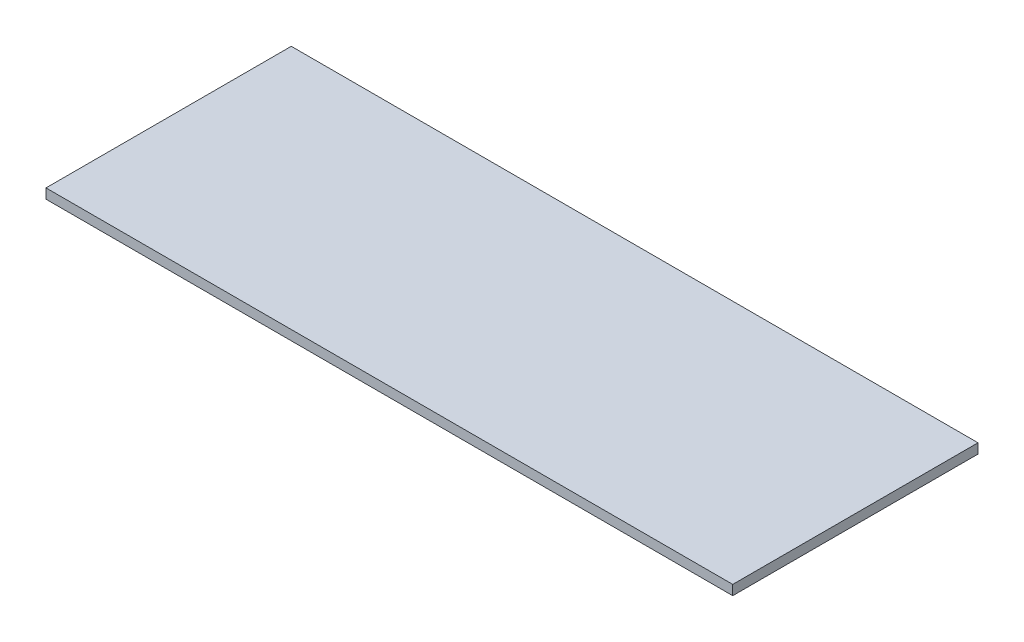
ISO-10303-21;
HEADER;
FILE_DESCRIPTION(('STEP AP214'),'2;1');
FILE_NAME('part.step','',(''),(''),'','','');
FILE_SCHEMA(('AUTOMOTIVE_DESIGN { 1 0 10303 214 1 1 1 1 }'));
ENDSEC;
DATA;
#1=APPLICATION_CONTEXT('core data for automotive mechanical design processes');
#2=APPLICATION_PROTOCOL_DEFINITION('international standard','automotive_design',2000,#1);
#3=PRODUCT_CONTEXT('',#1,'mechanical');
#4=PRODUCT('Part','Part','',(#3));
#5=PRODUCT_RELATED_PRODUCT_CATEGORY('part','',(#4));
#6=PRODUCT_DEFINITION_FORMATION('','',#4);
#7=PRODUCT_DEFINITION_CONTEXT('part definition',#1,'design');
#8=PRODUCT_DEFINITION('design','',#6,#7);
#9=PRODUCT_DEFINITION_SHAPE('','',#8);
#10=(LENGTH_UNIT() NAMED_UNIT(*) SI_UNIT(.MILLI.,.METRE.));
#11=(NAMED_UNIT(*) PLANE_ANGLE_UNIT() SI_UNIT($,.RADIAN.));
#12=(NAMED_UNIT(*) SI_UNIT($,.STERADIAN.) SOLID_ANGLE_UNIT());
#13=UNCERTAINTY_MEASURE_WITH_UNIT(LENGTH_MEASURE(1.E-05),#10,'distance_accuracy_value','');
#14=(GEOMETRIC_REPRESENTATION_CONTEXT(3) GLOBAL_UNCERTAINTY_ASSIGNED_CONTEXT((#13)) GLOBAL_UNIT_ASSIGNED_CONTEXT((#10,
#11,#12)) REPRESENTATION_CONTEXT('',''));
#15=CARTESIAN_POINT('',(0.,0.,0.));
#16=DIRECTION('',(0.,0.,1.));
#17=DIRECTION('',(1.,0.,0.));
#18=AXIS2_PLACEMENT_3D('',#15,#16,#17);
#19=CARTESIAN_POINT('',(-24.4855967078189,1.,-8.00411522633745));
#20=DIRECTION('',(1.,0.,0.));
#21=DIRECTION('',(0.,0.,-1.));
#22=AXIS2_PLACEMENT_3D('',#19,#20,#21);
#23=PLANE('',#22);
#24=DIRECTION('',(0.,0.,1.));
#25=VECTOR('',#24,1.);
#26=CARTESIAN_POINT('',(-24.4855967078189,0.,-8.00411522633745));
#27=LINE('',#26,#25);
#28=CARTESIAN_POINT('',(-24.4855967078189,0.,-8.00411522633745));
#29=VERTEX_POINT('',#28);
#30=CARTESIAN_POINT('',(-24.4855967078189,0.,16.9958847736625));
#31=VERTEX_POINT('',#30);
#32=EDGE_CURVE('E97',#29,#31,#27,.T.);
#33=ORIENTED_EDGE('',*,*,#32,.T.);
#34=DIRECTION('',(0.,-1.,0.));
#35=VECTOR('',#34,1.);
#36=CARTESIAN_POINT('',(-24.4855967078189,1.,16.9958847736625));
#37=LINE('',#36,#35);
#38=CARTESIAN_POINT('',(-24.4855967078189,1.,16.9958847736625));
#39=VERTEX_POINT('',#38);
#40=EDGE_CURVE('E11',#39,#31,#37,.T.);
#41=ORIENTED_EDGE('',*,*,#40,.F.);
#42=DIRECTION('',(0.,0.,1.));
#43=VECTOR('',#42,1.);
#44=CARTESIAN_POINT('',(-24.4855967078189,1.,-8.00411522633745));
#45=LINE('',#44,#43);
#46=CARTESIAN_POINT('',(-24.4855967078189,1.,-8.00411522633745));
#47=VERTEX_POINT('',#46);
#48=EDGE_CURVE('E85',#47,#39,#45,.T.);
#49=ORIENTED_EDGE('',*,*,#48,.F.);
#50=DIRECTION('',(0.,-1.,0.));
#51=VECTOR('',#50,1.);
#52=CARTESIAN_POINT('',(-24.4855967078189,1.,-8.00411522633745));
#53=LINE('',#52,#51);
#54=EDGE_CURVE('E93',#47,#29,#53,.T.);
#55=ORIENTED_EDGE('',*,*,#54,.T.);
#56=EDGE_LOOP('',(#33,#41,#49,#55));
#57=FACE_BOUND('',#56,.T.);
#58=ADVANCED_FACE('F34',(#57),#23,.F.);
#59=CARTESIAN_POINT('',(-24.4855967078189,1.,16.9958847736625));
#60=DIRECTION('',(0.,0.,-1.));
#61=DIRECTION('',(-1.,0.,0.));
#62=AXIS2_PLACEMENT_3D('',#59,#60,#61);
#63=PLANE('',#62);
#64=DIRECTION('',(1.,0.,0.));
#65=VECTOR('',#64,1.);
#66=CARTESIAN_POINT('',(-24.4855967078189,0.,16.9958847736625));
#67=LINE('',#66,#65);
#68=CARTESIAN_POINT('',(45.5144032921811,0.,16.9958847736625));
#69=VERTEX_POINT('',#68);
#70=EDGE_CURVE('E89',#31,#69,#67,.T.);
#71=ORIENTED_EDGE('',*,*,#70,.T.);
#72=DIRECTION('',(0.,-1.,0.));
#73=VECTOR('',#72,1.);
#74=CARTESIAN_POINT('',(45.5144032921811,1.,16.9958847736625));
#75=LINE('',#74,#73);
#76=CARTESIAN_POINT('',(45.5144032921811,1.,16.9958847736625));
#77=VERTEX_POINT('',#76);
#78=EDGE_CURVE('E42',#77,#69,#75,.T.);
#79=ORIENTED_EDGE('',*,*,#78,.F.);
#80=DIRECTION('',(1.,0.,0.));
#81=VECTOR('',#80,1.);
#82=CARTESIAN_POINT('',(-24.4855967078189,1.,16.9958847736625));
#83=LINE('',#82,#81);
#84=EDGE_CURVE('E80',#39,#77,#83,.T.);
#85=ORIENTED_EDGE('',*,*,#84,.F.);
#86=ORIENTED_EDGE('',*,*,#40,.T.);
#87=EDGE_LOOP('',(#71,#79,#85,#86));
#88=FACE_BOUND('',#87,.T.);
#89=ADVANCED_FACE('F88',(#88),#63,.F.);
#90=CARTESIAN_POINT('',(45.5144032921811,1.,-8.00411522633745));
#91=DIRECTION('',(-1.,0.,0.));
#92=DIRECTION('',(0.,0.,1.));
#93=AXIS2_PLACEMENT_3D('',#90,#91,#92);
#94=PLANE('',#93);
#95=DIRECTION('',(0.,0.,-1.));
#96=VECTOR('',#95,1.);
#97=CARTESIAN_POINT('',(45.5144032921811,0.,-8.00411522633745));
#98=LINE('',#97,#96);
#99=CARTESIAN_POINT('',(45.5144032921811,0.,-8.00411522633745));
#100=VERTEX_POINT('',#99);
#101=EDGE_CURVE('E67',#69,#100,#98,.T.);
#102=ORIENTED_EDGE('',*,*,#101,.T.);
#103=DIRECTION('',(0.,-1.,0.));
#104=VECTOR('',#103,1.);
#105=CARTESIAN_POINT('',(45.5144032921811,1.,-8.00411522633745));
#106=LINE('',#105,#104);
#107=CARTESIAN_POINT('',(45.5144032921811,1.,-8.00411522633745));
#108=VERTEX_POINT('',#107);
#109=EDGE_CURVE('E90',#108,#100,#106,.T.);
#110=ORIENTED_EDGE('',*,*,#109,.F.);
#111=DIRECTION('',(0.,0.,-1.));
#112=VECTOR('',#111,1.);
#113=CARTESIAN_POINT('',(45.5144032921811,1.,-8.00411522633745));
#114=LINE('',#113,#112);
#115=EDGE_CURVE('E83',#77,#108,#114,.T.);
#116=ORIENTED_EDGE('',*,*,#115,.F.);
#117=ORIENTED_EDGE('',*,*,#78,.T.);
#118=EDGE_LOOP('',(#102,#110,#116,#117));
#119=FACE_BOUND('',#118,.T.);
#120=ADVANCED_FACE('F91',(#119),#94,.F.);
#121=CARTESIAN_POINT('',(-24.4855967078189,1.,-8.00411522633745));
#122=DIRECTION('',(0.,0.,1.));
#123=DIRECTION('',(1.,0.,0.));
#124=AXIS2_PLACEMENT_3D('',#121,#122,#123);
#125=PLANE('',#124);
#126=DIRECTION('',(-1.,0.,0.));
#127=VECTOR('',#126,1.);
#128=CARTESIAN_POINT('',(-24.4855967078189,0.,-8.00411522633745));
#129=LINE('',#128,#127);
#130=EDGE_CURVE('E73',#100,#29,#129,.T.);
#131=ORIENTED_EDGE('',*,*,#130,.T.);
#132=ORIENTED_EDGE('',*,*,#54,.F.);
#133=DIRECTION('',(-1.,0.,0.));
#134=VECTOR('',#133,1.);
#135=CARTESIAN_POINT('',(-24.4855967078189,1.,-8.00411522633745));
#136=LINE('',#135,#134);
#137=EDGE_CURVE('E50',#108,#47,#136,.T.);
#138=ORIENTED_EDGE('',*,*,#137,.F.);
#139=ORIENTED_EDGE('',*,*,#109,.T.);
#140=EDGE_LOOP('',(#131,#132,#138,#139));
#141=FACE_BOUND('',#140,.T.);
#142=ADVANCED_FACE('F104',(#141),#125,.F.);
#143=CARTESIAN_POINT('',(0.,1.,0.));
#144=DIRECTION('',(0.,1.,0.));
#145=DIRECTION('',(0.,0.,1.));
#146=AXIS2_PLACEMENT_3D('',#143,#144,#145);
#147=PLANE('',#146);
#148=ORIENTED_EDGE('',*,*,#48,.T.);
#149=ORIENTED_EDGE('',*,*,#84,.T.);
#150=ORIENTED_EDGE('',*,*,#115,.T.);
#151=ORIENTED_EDGE('',*,*,#137,.T.);
#152=EDGE_LOOP('',(#148,#149,#150,#151));
#153=FACE_BOUND('',#152,.T.);
#154=ADVANCED_FACE('F81',(#153),#147,.T.);
#155=CARTESIAN_POINT('',(0.,0.,0.));
#156=DIRECTION('',(0.,1.,0.));
#157=DIRECTION('',(0.,0.,1.));
#158=AXIS2_PLACEMENT_3D('',#155,#156,#157);
#159=PLANE('',#158);
#160=ORIENTED_EDGE('',*,*,#32,.F.);
#161=ORIENTED_EDGE('',*,*,#130,.F.);
#162=ORIENTED_EDGE('',*,*,#101,.F.);
#163=ORIENTED_EDGE('',*,*,#70,.F.);
#164=EDGE_LOOP('',(#160,#161,#162,#163));
#165=FACE_BOUND('',#164,.T.);
#166=ADVANCED_FACE('F107',(#165),#159,.F.);
#167=CLOSED_SHELL('',(#58,#89,#120,#142,#154,#166));
#168=MANIFOLD_SOLID_BREP('B2',#167);
#169=ADVANCED_BREP_SHAPE_REPRESENTATION('',(#18,#168),#14);
#170=SHAPE_DEFINITION_REPRESENTATION(#9,#169);
ENDSEC;
END-ISO-10303-21;
